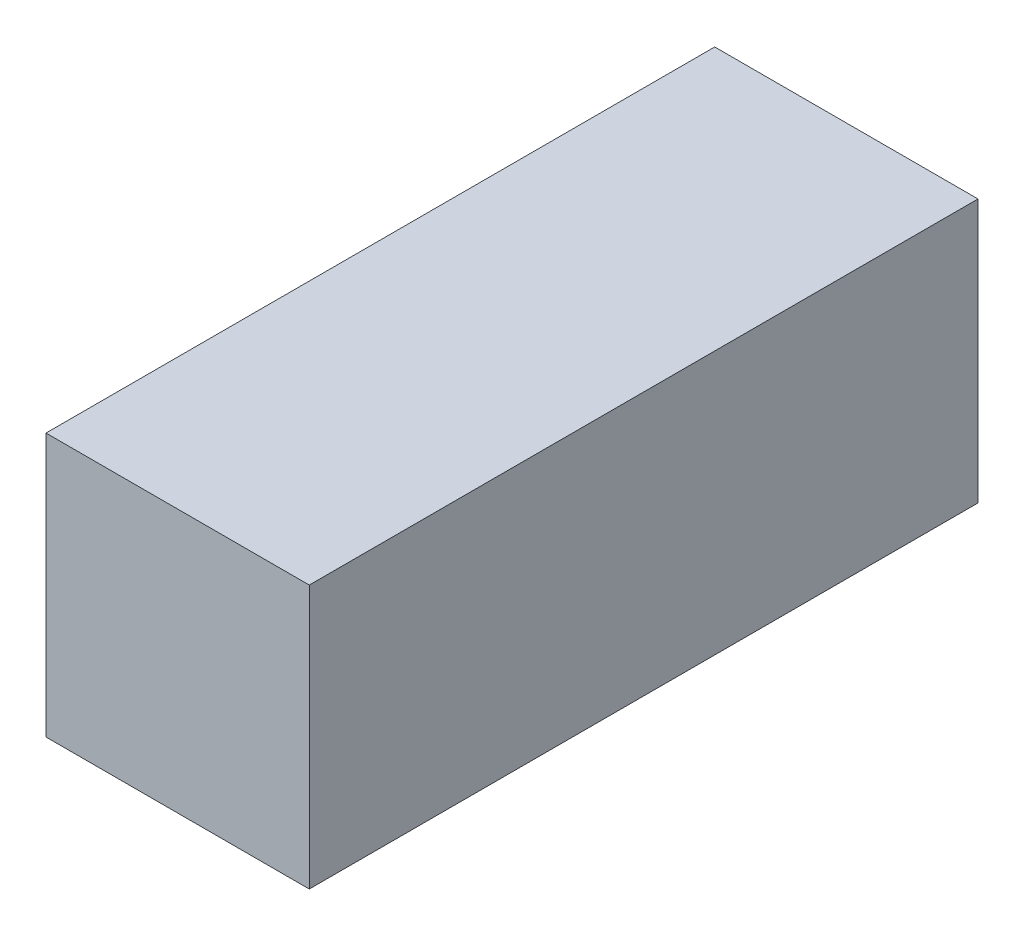
ISO-10303-21;
HEADER;
FILE_DESCRIPTION(('STEP AP214'),'2;1');
FILE_NAME('part.step','',(''),(''),'','','');
FILE_SCHEMA(('AUTOMOTIVE_DESIGN { 1 0 10303 214 1 1 1 1 }'));
ENDSEC;
DATA;
#1=APPLICATION_CONTEXT('core data for automotive mechanical design processes');
#2=APPLICATION_PROTOCOL_DEFINITION('international standard','automotive_design',2000,#1);
#3=PRODUCT_CONTEXT('',#1,'mechanical');
#4=PRODUCT('Part','Part','',(#3));
#5=PRODUCT_RELATED_PRODUCT_CATEGORY('part','',(#4));
#6=PRODUCT_DEFINITION_FORMATION('','',#4);
#7=PRODUCT_DEFINITION_CONTEXT('part definition',#1,'design');
#8=PRODUCT_DEFINITION('design','',#6,#7);
#9=PRODUCT_DEFINITION_SHAPE('','',#8);
#10=(LENGTH_UNIT() NAMED_UNIT(*) SI_UNIT(.MILLI.,.METRE.));
#11=(NAMED_UNIT(*) PLANE_ANGLE_UNIT() SI_UNIT($,.RADIAN.));
#12=(NAMED_UNIT(*) SI_UNIT($,.STERADIAN.) SOLID_ANGLE_UNIT());
#13=UNCERTAINTY_MEASURE_WITH_UNIT(LENGTH_MEASURE(1.E-05),#10,'distance_accuracy_value','');
#14=(GEOMETRIC_REPRESENTATION_CONTEXT(3) GLOBAL_UNCERTAINTY_ASSIGNED_CONTEXT((#13)) GLOBAL_UNIT_ASSIGNED_CONTEXT((#10,
#11,#12)) REPRESENTATION_CONTEXT('',''));
#15=CARTESIAN_POINT('',(0.,0.,0.));
#16=DIRECTION('',(0.,0.,1.));
#17=DIRECTION('',(1.,0.,0.));
#18=AXIS2_PLACEMENT_3D('',#15,#16,#17);
#19=CARTESIAN_POINT('',(0.0799263999999167,0.0937066000000208,12.7));
#20=DIRECTION('',(0.,1.,0.));
#21=DIRECTION('',(0.,0.,1.));
#22=AXIS2_PLACEMENT_3D('',#19,#20,#21);
#23=PLANE('',#22);
#24=DIRECTION('',(1.,0.,0.));
#25=VECTOR('',#24,1.);
#26=CARTESIAN_POINT('',(0.0799263999999167,0.0937066000000208,0.));
#27=LINE('',#26,#25);
#28=CARTESIAN_POINT('',(0.0799263999999167,0.0937066000000208,0.));
#29=VERTEX_POINT('',#28);
#30=CARTESIAN_POINT('',(5.07992639999992,0.0937066000000208,0.));
#31=VERTEX_POINT('',#30);
#32=EDGE_CURVE('E96',#29,#31,#27,.T.);
#33=ORIENTED_EDGE('',*,*,#32,.T.);
#34=DIRECTION('',(0.,0.,-1.));
#35=VECTOR('',#34,1.);
#36=CARTESIAN_POINT('',(5.07992639999992,0.0937066000000208,12.7));
#37=LINE('',#36,#35);
#38=CARTESIAN_POINT('',(5.07992639999992,0.0937066000000208,12.7));
#39=VERTEX_POINT('',#38);
#40=EDGE_CURVE('E11',#39,#31,#37,.T.);
#41=ORIENTED_EDGE('',*,*,#40,.F.);
#42=DIRECTION('',(1.,0.,0.));
#43=VECTOR('',#42,1.);
#44=CARTESIAN_POINT('',(0.0799263999999167,0.0937066000000208,12.7));
#45=LINE('',#44,#43);
#46=CARTESIAN_POINT('',(0.0799263999999167,0.0937066000000208,12.7));
#47=VERTEX_POINT('',#46);
#48=EDGE_CURVE('E84',#47,#39,#45,.T.);
#49=ORIENTED_EDGE('',*,*,#48,.F.);
#50=DIRECTION('',(0.,0.,-1.));
#51=VECTOR('',#50,1.);
#52=CARTESIAN_POINT('',(0.0799263999999167,0.0937066000000208,12.7));
#53=LINE('',#52,#51);
#54=EDGE_CURVE('E92',#47,#29,#53,.T.);
#55=ORIENTED_EDGE('',*,*,#54,.T.);
#56=EDGE_LOOP('',(#33,#41,#49,#55));
#57=FACE_BOUND('',#56,.T.);
#58=ADVANCED_FACE('F33',(#57),#23,.F.);
#59=CARTESIAN_POINT('',(5.07992639999992,0.0937066000000208,12.7));
#60=DIRECTION('',(-1.,0.,0.));
#61=DIRECTION('',(0.,0.,1.));
#62=AXIS2_PLACEMENT_3D('',#59,#60,#61);
#63=PLANE('',#62);
#64=DIRECTION('',(0.,1.,0.));
#65=VECTOR('',#64,1.);
#66=CARTESIAN_POINT('',(5.07992639999992,0.0937066000000208,0.));
#67=LINE('',#66,#65);
#68=CARTESIAN_POINT('',(5.07992639999992,5.09370660000003,0.));
#69=VERTEX_POINT('',#68);
#70=EDGE_CURVE('E88',#31,#69,#67,.T.);
#71=ORIENTED_EDGE('',*,*,#70,.T.);
#72=DIRECTION('',(0.,0.,-1.));
#73=VECTOR('',#72,1.);
#74=CARTESIAN_POINT('',(5.07992639999992,5.09370660000003,12.7));
#75=LINE('',#74,#73);
#76=CARTESIAN_POINT('',(5.07992639999992,5.09370660000003,12.7));
#77=VERTEX_POINT('',#76);
#78=EDGE_CURVE('E41',#77,#69,#75,.T.);
#79=ORIENTED_EDGE('',*,*,#78,.F.);
#80=DIRECTION('',(0.,1.,0.));
#81=VECTOR('',#80,1.);
#82=CARTESIAN_POINT('',(5.07992639999992,0.0937066000000208,12.7));
#83=LINE('',#82,#81);
#84=EDGE_CURVE('E79',#39,#77,#83,.T.);
#85=ORIENTED_EDGE('',*,*,#84,.F.);
#86=ORIENTED_EDGE('',*,*,#40,.T.);
#87=EDGE_LOOP('',(#71,#79,#85,#86));
#88=FACE_BOUND('',#87,.T.);
#89=ADVANCED_FACE('F87',(#88),#63,.F.);
#90=CARTESIAN_POINT('',(0.0799263999999167,5.09370660000003,12.7));
#91=DIRECTION('',(0.,-1.,0.));
#92=DIRECTION('',(0.,0.,-1.));
#93=AXIS2_PLACEMENT_3D('',#90,#91,#92);
#94=PLANE('',#93);
#95=DIRECTION('',(-1.,0.,0.));
#96=VECTOR('',#95,1.);
#97=CARTESIAN_POINT('',(0.0799263999999167,5.09370660000003,0.));
#98=LINE('',#97,#96);
#99=CARTESIAN_POINT('',(0.0799263999999167,5.09370660000003,0.));
#100=VERTEX_POINT('',#99);
#101=EDGE_CURVE('E66',#69,#100,#98,.T.);
#102=ORIENTED_EDGE('',*,*,#101,.T.);
#103=DIRECTION('',(0.,0.,-1.));
#104=VECTOR('',#103,1.);
#105=CARTESIAN_POINT('',(0.0799263999999167,5.09370660000003,12.7));
#106=LINE('',#105,#104);
#107=CARTESIAN_POINT('',(0.0799263999999167,5.09370660000003,12.7));
#108=VERTEX_POINT('',#107);
#109=EDGE_CURVE('E89',#108,#100,#106,.T.);
#110=ORIENTED_EDGE('',*,*,#109,.F.);
#111=DIRECTION('',(-1.,0.,0.));
#112=VECTOR('',#111,1.);
#113=CARTESIAN_POINT('',(0.0799263999999167,5.09370660000003,12.7));
#114=LINE('',#113,#112);
#115=EDGE_CURVE('E82',#77,#108,#114,.T.);
#116=ORIENTED_EDGE('',*,*,#115,.F.);
#117=ORIENTED_EDGE('',*,*,#78,.T.);
#118=EDGE_LOOP('',(#102,#110,#116,#117));
#119=FACE_BOUND('',#118,.T.);
#120=ADVANCED_FACE('F90',(#119),#94,.F.);
#121=CARTESIAN_POINT('',(0.0799263999999167,0.0937066000000208,12.7));
#122=DIRECTION('',(1.,0.,0.));
#123=DIRECTION('',(0.,0.,-1.));
#124=AXIS2_PLACEMENT_3D('',#121,#122,#123);
#125=PLANE('',#124);
#126=DIRECTION('',(0.,-1.,0.));
#127=VECTOR('',#126,1.);
#128=CARTESIAN_POINT('',(0.0799263999999167,0.0937066000000208,0.));
#129=LINE('',#128,#127);
#130=EDGE_CURVE('E72',#100,#29,#129,.T.);
#131=ORIENTED_EDGE('',*,*,#130,.T.);
#132=ORIENTED_EDGE('',*,*,#54,.F.);
#133=DIRECTION('',(0.,-1.,0.));
#134=VECTOR('',#133,1.);
#135=CARTESIAN_POINT('',(0.0799263999999167,0.0937066000000208,12.7));
#136=LINE('',#135,#134);
#137=EDGE_CURVE('E49',#108,#47,#136,.T.);
#138=ORIENTED_EDGE('',*,*,#137,.F.);
#139=ORIENTED_EDGE('',*,*,#109,.T.);
#140=EDGE_LOOP('',(#131,#132,#138,#139));
#141=FACE_BOUND('',#140,.T.);
#142=ADVANCED_FACE('F103',(#141),#125,.F.);
#143=CARTESIAN_POINT('',(0.,0.,12.7));
#144=DIRECTION('',(0.,0.,1.));
#145=DIRECTION('',(1.,0.,0.));
#146=AXIS2_PLACEMENT_3D('',#143,#144,#145);
#147=PLANE('',#146);
#148=ORIENTED_EDGE('',*,*,#48,.T.);
#149=ORIENTED_EDGE('',*,*,#84,.T.);
#150=ORIENTED_EDGE('',*,*,#115,.T.);
#151=ORIENTED_EDGE('',*,*,#137,.T.);
#152=EDGE_LOOP('',(#148,#149,#150,#151));
#153=FACE_BOUND('',#152,.T.);
#154=ADVANCED_FACE('F80',(#153),#147,.T.);
#155=CARTESIAN_POINT('',(0.,0.,0.));
#156=DIRECTION('',(0.,0.,1.));
#157=DIRECTION('',(1.,0.,0.));
#158=AXIS2_PLACEMENT_3D('',#155,#156,#157);
#159=PLANE('',#158);
#160=ORIENTED_EDGE('',*,*,#32,.F.);
#161=ORIENTED_EDGE('',*,*,#130,.F.);
#162=ORIENTED_EDGE('',*,*,#101,.F.);
#163=ORIENTED_EDGE('',*,*,#70,.F.);
#164=EDGE_LOOP('',(#160,#161,#162,#163));
#165=FACE_BOUND('',#164,.T.);
#166=ADVANCED_FACE('F106',(#165),#159,.F.);
#167=CLOSED_SHELL('',(#58,#89,#120,#142,#154,#166));
#168=MANIFOLD_SOLID_BREP('B2',#167);
#169=ADVANCED_BREP_SHAPE_REPRESENTATION('',(#18,#168),#14);
#170=SHAPE_DEFINITION_REPRESENTATION(#9,#169);
ENDSEC;
END-ISO-10303-21;
